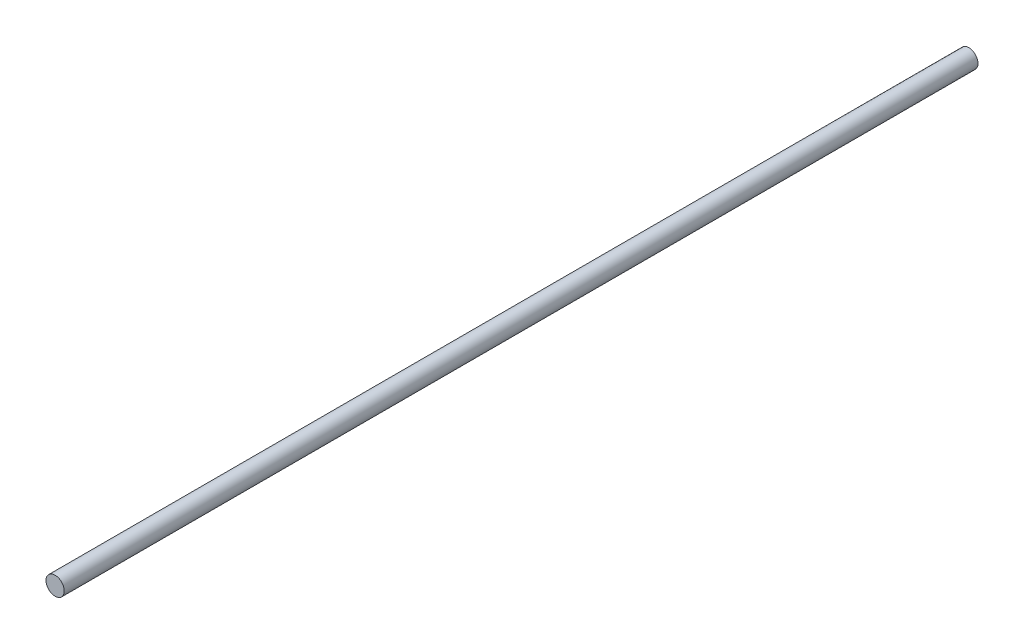
ISO-10303-21;
HEADER;
FILE_DESCRIPTION(('STEP AP214'),'2;1');
FILE_NAME('part.step','',(''),(''),'','','');
FILE_SCHEMA(('AUTOMOTIVE_DESIGN { 1 0 10303 214 1 1 1 1 }'));
ENDSEC;
DATA;
#1=APPLICATION_CONTEXT('core data for automotive mechanical design processes');
#2=APPLICATION_PROTOCOL_DEFINITION('international standard','automotive_design',2000,#1);
#3=PRODUCT_CONTEXT('',#1,'mechanical');
#4=PRODUCT('Part','Part','',(#3));
#5=PRODUCT_RELATED_PRODUCT_CATEGORY('part','',(#4));
#6=PRODUCT_DEFINITION_FORMATION('','',#4);
#7=PRODUCT_DEFINITION_CONTEXT('part definition',#1,'design');
#8=PRODUCT_DEFINITION('design','',#6,#7);
#9=PRODUCT_DEFINITION_SHAPE('','',#8);
#10=(LENGTH_UNIT() NAMED_UNIT(*) SI_UNIT(.MILLI.,.METRE.));
#11=(NAMED_UNIT(*) PLANE_ANGLE_UNIT() SI_UNIT($,.RADIAN.));
#12=(NAMED_UNIT(*) SI_UNIT($,.STERADIAN.) SOLID_ANGLE_UNIT());
#13=UNCERTAINTY_MEASURE_WITH_UNIT(LENGTH_MEASURE(1.E-05),#10,'distance_accuracy_value','');
#14=(GEOMETRIC_REPRESENTATION_CONTEXT(3) GLOBAL_UNCERTAINTY_ASSIGNED_CONTEXT((#13)) GLOBAL_UNIT_ASSIGNED_CONTEXT((#10,
#11,#12)) REPRESENTATION_CONTEXT('',''));
#15=CARTESIAN_POINT('',(0.,0.,0.));
#16=DIRECTION('',(0.,0.,1.));
#17=DIRECTION('',(1.,0.,0.));
#18=AXIS2_PLACEMENT_3D('',#15,#16,#17);
#19=CARTESIAN_POINT('',(0.,0.,400.));
#20=DIRECTION('',(0.,0.,-1.));
#21=DIRECTION('',(-1.,0.,0.));
#22=AXIS2_PLACEMENT_3D('',#19,#20,#21);
#23=CYLINDRICAL_SURFACE('',#22,4.);
#24=CARTESIAN_POINT('',(0.,0.,400.));
#25=DIRECTION('',(0.,0.,1.));
#26=DIRECTION('',(1.,0.,0.));
#27=AXIS2_PLACEMENT_3D('',#24,#25,#26);
#28=CIRCLE('',#27,4.);
#29=CARTESIAN_POINT('',(4.,0.,400.));
#30=VERTEX_POINT('',#29);
#31=EDGE_CURVE('E10',#30,#30,#28,.T.);
#32=ORIENTED_EDGE('',*,*,#31,.F.);
#33=EDGE_LOOP('',(#32));
#34=FACE_BOUND('',#33,.T.);
#35=CARTESIAN_POINT('',(0.,0.,0.));
#36=DIRECTION('',(0.,0.,1.));
#37=DIRECTION('',(1.,0.,0.));
#38=AXIS2_PLACEMENT_3D('',#35,#36,#37);
#39=CIRCLE('',#38,4.);
#40=CARTESIAN_POINT('',(4.,0.,0.));
#41=VERTEX_POINT('',#40);
#42=EDGE_CURVE('E33',#41,#41,#39,.T.);
#43=ORIENTED_EDGE('',*,*,#42,.T.);
#44=EDGE_LOOP('',(#43));
#45=FACE_BOUND('',#44,.T.);
#46=ADVANCED_FACE('F30',(#34,#45),#23,.T.);
#47=CARTESIAN_POINT('',(0.,0.,400.));
#48=DIRECTION('',(0.,0.,1.));
#49=DIRECTION('',(1.,0.,0.));
#50=AXIS2_PLACEMENT_3D('',#47,#48,#49);
#51=PLANE('',#50);
#52=ORIENTED_EDGE('',*,*,#31,.T.);
#53=EDGE_LOOP('',(#52));
#54=FACE_BOUND('',#53,.T.);
#55=ADVANCED_FACE('F45',(#54),#51,.T.);
#56=CARTESIAN_POINT('',(0.,0.,0.));
#57=DIRECTION('',(0.,0.,1.));
#58=DIRECTION('',(1.,0.,0.));
#59=AXIS2_PLACEMENT_3D('',#56,#57,#58);
#60=PLANE('',#59);
#61=ORIENTED_EDGE('',*,*,#42,.F.);
#62=EDGE_LOOP('',(#61));
#63=FACE_BOUND('',#62,.T.);
#64=ADVANCED_FACE('F43',(#63),#60,.F.);
#65=CLOSED_SHELL('',(#46,#55,#64));
#66=MANIFOLD_SOLID_BREP('B2',#65);
#67=ADVANCED_BREP_SHAPE_REPRESENTATION('',(#18,#66),#14);
#68=SHAPE_DEFINITION_REPRESENTATION(#9,#67);
ENDSEC;
END-ISO-10303-21;
